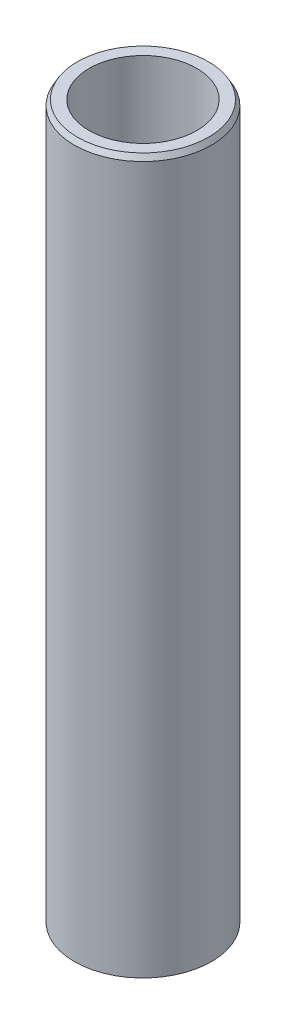
ISO-10303-21;
HEADER;
FILE_DESCRIPTION(('STEP AP214'),'2;1');
FILE_NAME('part.step','',(''),(''),'','','');
FILE_SCHEMA(('AUTOMOTIVE_DESIGN { 1 0 10303 214 1 1 1 1 }'));
ENDSEC;
DATA;
#1=APPLICATION_CONTEXT('core data for automotive mechanical design processes');
#2=APPLICATION_PROTOCOL_DEFINITION('international standard','automotive_design',2000,#1);
#3=PRODUCT_CONTEXT('',#1,'mechanical');
#4=PRODUCT('Part','Part','',(#3));
#5=PRODUCT_RELATED_PRODUCT_CATEGORY('part','',(#4));
#6=PRODUCT_DEFINITION_FORMATION('','',#4);
#7=PRODUCT_DEFINITION_CONTEXT('part definition',#1,'design');
#8=PRODUCT_DEFINITION('design','',#6,#7);
#9=PRODUCT_DEFINITION_SHAPE('','',#8);
#10=(LENGTH_UNIT() NAMED_UNIT(*) SI_UNIT(.MILLI.,.METRE.));
#11=(NAMED_UNIT(*) PLANE_ANGLE_UNIT() SI_UNIT($,.RADIAN.));
#12=(NAMED_UNIT(*) SI_UNIT($,.STERADIAN.) SOLID_ANGLE_UNIT());
#13=UNCERTAINTY_MEASURE_WITH_UNIT(LENGTH_MEASURE(1.E-05),#10,'distance_accuracy_value','');
#14=(GEOMETRIC_REPRESENTATION_CONTEXT(3) GLOBAL_UNCERTAINTY_ASSIGNED_CONTEXT((#13)) GLOBAL_UNIT_ASSIGNED_CONTEXT((#10,
#11,#12)) REPRESENTATION_CONTEXT('',''));
#15=CARTESIAN_POINT('',(0.,0.,0.));
#16=DIRECTION('',(0.,0.,1.));
#17=DIRECTION('',(1.,0.,0.));
#18=AXIS2_PLACEMENT_3D('',#15,#16,#17);
#19=CARTESIAN_POINT('',(0.,600.,0.));
#20=DIRECTION('',(0.,-1.,0.));
#21=DIRECTION('',(0.,0.,-1.));
#22=AXIS2_PLACEMENT_3D('',#19,#20,#21);
#23=CYLINDRICAL_SURFACE('',#22,57.5);
#24=CARTESIAN_POINT('',(0.,595.541189090668,0.));
#25=DIRECTION('',(0.,1.,0.));
#26=DIRECTION('',(0.,0.,1.));
#27=AXIS2_PLACEMENT_3D('',#24,#25,#26);
#28=CIRCLE('',#27,57.5);
#29=CARTESIAN_POINT('',(0.,595.541189090668,57.5));
#30=VERTEX_POINT('',#29);
#31=EDGE_CURVE('E50',#30,#30,#28,.F.);
#32=ORIENTED_EDGE('',*,*,#31,.T.);
#33=EDGE_LOOP('',(#32));
#34=FACE_BOUND('',#33,.T.);
#35=CARTESIAN_POINT('',(0.,2.57429567876855,0.));
#36=DIRECTION('',(0.,1.,0.));
#37=DIRECTION('',(0.,0.,1.));
#38=AXIS2_PLACEMENT_3D('',#35,#36,#37);
#39=CIRCLE('',#38,57.5);
#40=CARTESIAN_POINT('',(0.,2.57429567876855,57.5));
#41=VERTEX_POINT('',#40);
#42=EDGE_CURVE('E51',#41,#41,#39,.T.);
#43=ORIENTED_EDGE('',*,*,#42,.T.);
#44=EDGE_LOOP('',(#43));
#45=FACE_BOUND('',#44,.T.);
#46=ADVANCED_FACE('F39',(#34,#45),#23,.T.);
#47=CARTESIAN_POINT('',(0.,600.,0.));
#48=DIRECTION('',(0.,1.,0.));
#49=DIRECTION('',(0.,0.,1.));
#50=AXIS2_PLACEMENT_3D('',#47,#48,#49);
#51=PLANE('',#50);
#52=CARTESIAN_POINT('',(0.,600.,0.));
#53=DIRECTION('',(0.,1.,0.));
#54=DIRECTION('',(0.,0.,1.));
#55=AXIS2_PLACEMENT_3D('',#52,#53,#54);
#56=CIRCLE('',#55,54.9257043212313);
#57=CARTESIAN_POINT('',(0.,600.,54.9257043212313));
#58=VERTEX_POINT('',#57);
#59=EDGE_CURVE('E54',#58,#58,#56,.T.);
#60=ORIENTED_EDGE('',*,*,#59,.T.);
#61=EDGE_LOOP('',(#60));
#62=FACE_BOUND('',#61,.T.);
#63=CARTESIAN_POINT('',(0.,600.,0.));
#64=DIRECTION('',(0.,1.,0.));
#65=DIRECTION('',(0.,0.,1.));
#66=AXIS2_PLACEMENT_3D('',#63,#64,#65);
#67=CIRCLE('',#66,45.1914300076167);
#68=CARTESIAN_POINT('',(0.,600.,45.1914300076167));
#69=VERTEX_POINT('',#68);
#70=EDGE_CURVE('E58',#69,#69,#67,.T.);
#71=ORIENTED_EDGE('',*,*,#70,.F.);
#72=EDGE_LOOP('',(#71));
#73=FACE_BOUND('',#72,.T.);
#74=ADVANCED_FACE('F69',(#62,#73),#51,.T.);
#75=CARTESIAN_POINT('',(0.,0.,0.));
#76=DIRECTION('',(0.,1.,0.));
#77=DIRECTION('',(0.,0.,1.));
#78=AXIS2_PLACEMENT_3D('',#75,#76,#77);
#79=PLANE('',#78);
#80=CARTESIAN_POINT('',(0.,0.,0.));
#81=DIRECTION('',(0.,1.,0.));
#82=DIRECTION('',(0.,0.,1.));
#83=AXIS2_PLACEMENT_3D('',#80,#81,#82);
#84=CIRCLE('',#83,53.0411890906678);
#85=CARTESIAN_POINT('',(0.,0.,53.0411890906678));
#86=VERTEX_POINT('',#85);
#87=EDGE_CURVE('E10',#86,#86,#84,.F.);
#88=ORIENTED_EDGE('',*,*,#87,.T.);
#89=EDGE_LOOP('',(#88));
#90=FACE_BOUND('',#89,.T.);
#91=CARTESIAN_POINT('',(0.,0.,0.));
#92=DIRECTION('',(0.,1.,0.));
#93=DIRECTION('',(0.,0.,1.));
#94=AXIS2_PLACEMENT_3D('',#91,#92,#93);
#95=CIRCLE('',#94,45.1914300076167);
#96=CARTESIAN_POINT('',(0.,0.,45.1914300076167));
#97=VERTEX_POINT('',#96);
#98=EDGE_CURVE('E63',#97,#97,#95,.T.);
#99=ORIENTED_EDGE('',*,*,#98,.T.);
#100=EDGE_LOOP('',(#99));
#101=FACE_BOUND('',#100,.T.);
#102=ADVANCED_FACE('F75',(#90,#101),#79,.F.);
#103=CARTESIAN_POINT('',(0.,600.,0.));
#104=DIRECTION('',(0.,-1.,0.));
#105=DIRECTION('',(0.,0.,-1.));
#106=AXIS2_PLACEMENT_3D('',#103,#104,#105);
#107=CYLINDRICAL_SURFACE('',#106,45.1914300076167);
#108=ORIENTED_EDGE('',*,*,#70,.T.);
#109=EDGE_LOOP('',(#108));
#110=FACE_BOUND('',#109,.T.);
#111=ORIENTED_EDGE('',*,*,#98,.F.);
#112=EDGE_LOOP('',(#111));
#113=FACE_BOUND('',#112,.T.);
#114=ADVANCED_FACE('F70',(#110,#113),#107,.F.);
#115=CARTESIAN_POINT('',(0.,600.,0.));
#116=DIRECTION('',(0.,-1.,0.));
#117=DIRECTION('',(0.,0.,-1.));
#118=AXIS2_PLACEMENT_3D('',#115,#116,#117);
#119=CONICAL_SURFACE('',#118,54.9257043212313,0.523598775598312);
#120=ORIENTED_EDGE('',*,*,#31,.F.);
#121=EDGE_LOOP('',(#120));
#122=FACE_BOUND('',#121,.T.);
#123=ORIENTED_EDGE('',*,*,#59,.F.);
#124=EDGE_LOOP('',(#123));
#125=FACE_BOUND('',#124,.T.);
#126=ADVANCED_FACE('F81',(#122,#125),#119,.T.);
#127=CARTESIAN_POINT('',(0.,2.57429567876855,0.));
#128=DIRECTION('',(0.,1.,0.));
#129=DIRECTION('',(0.,0.,1.));
#130=AXIS2_PLACEMENT_3D('',#127,#128,#129);
#131=CONICAL_SURFACE('',#130,57.5,1.04719755119661);
#132=ORIENTED_EDGE('',*,*,#87,.F.);
#133=EDGE_LOOP('',(#132));
#134=FACE_BOUND('',#133,.T.);
#135=ORIENTED_EDGE('',*,*,#42,.F.);
#136=EDGE_LOOP('',(#135));
#137=FACE_BOUND('',#136,.T.);
#138=ADVANCED_FACE('F45',(#134,#137),#131,.T.);
#139=CLOSED_SHELL('',(#46,#74,#102,#114,#126,#138));
#140=MANIFOLD_SOLID_BREP('B2',#139);
#141=ADVANCED_BREP_SHAPE_REPRESENTATION('',(#18,#140),#14);
#142=SHAPE_DEFINITION_REPRESENTATION(#9,#141);
ENDSEC;
END-ISO-10303-21;
